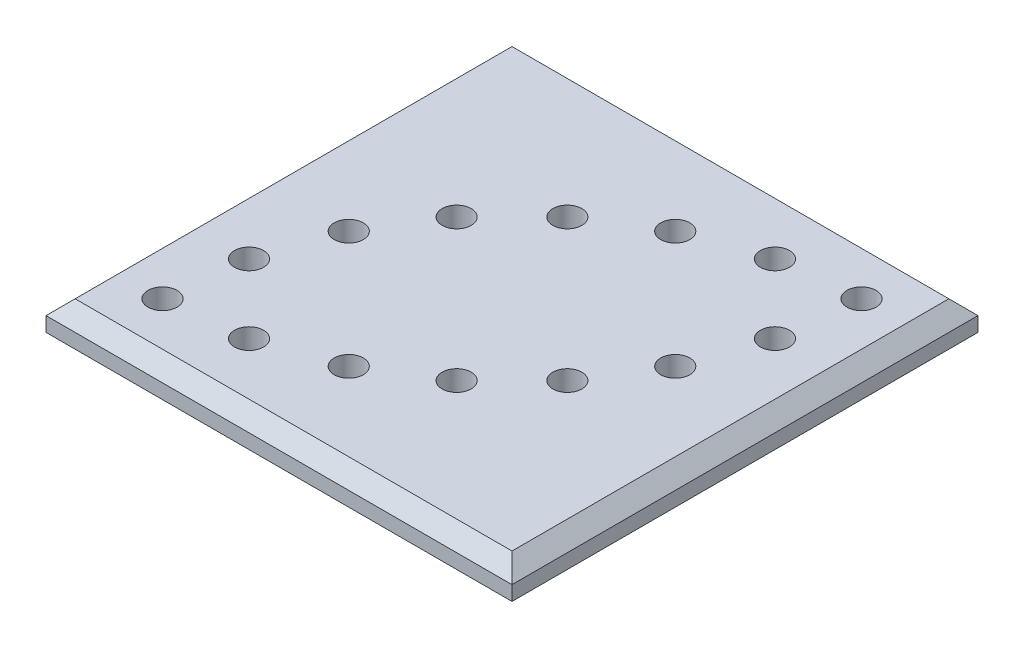
ISO-10303-21;
HEADER;
FILE_DESCRIPTION(('STEP AP214'),'2;1');
FILE_NAME('part.step','',(''),(''),'','','');
FILE_SCHEMA(('AUTOMOTIVE_DESIGN { 1 0 10303 214 1 1 1 1 }'));
ENDSEC;
DATA;
#1=APPLICATION_CONTEXT('core data for automotive mechanical design processes');
#2=APPLICATION_PROTOCOL_DEFINITION('international standard','automotive_design',2000,#1);
#3=PRODUCT_CONTEXT('',#1,'mechanical');
#4=PRODUCT('Part','Part','',(#3));
#5=PRODUCT_RELATED_PRODUCT_CATEGORY('part','',(#4));
#6=PRODUCT_DEFINITION_FORMATION('','',#4);
#7=PRODUCT_DEFINITION_CONTEXT('part definition',#1,'design');
#8=PRODUCT_DEFINITION('design','',#6,#7);
#9=PRODUCT_DEFINITION_SHAPE('','',#8);
#10=(LENGTH_UNIT() NAMED_UNIT(*) SI_UNIT(.MILLI.,.METRE.));
#11=(NAMED_UNIT(*) PLANE_ANGLE_UNIT() SI_UNIT($,.RADIAN.));
#12=(NAMED_UNIT(*) SI_UNIT($,.STERADIAN.) SOLID_ANGLE_UNIT());
#13=UNCERTAINTY_MEASURE_WITH_UNIT(LENGTH_MEASURE(1.E-05),#10,'distance_accuracy_value','');
#14=(GEOMETRIC_REPRESENTATION_CONTEXT(3) GLOBAL_UNCERTAINTY_ASSIGNED_CONTEXT((#13)) GLOBAL_UNIT_ASSIGNED_CONTEXT((#10,
#11,#12)) REPRESENTATION_CONTEXT('',''));
#15=CARTESIAN_POINT('',(0.,0.,0.));
#16=DIRECTION('',(0.,0.,1.));
#17=DIRECTION('',(1.,0.,0.));
#18=AXIS2_PLACEMENT_3D('',#15,#16,#17);
#19=CARTESIAN_POINT('',(50.8,9.525,50.8));
#20=DIRECTION('',(-1.,0.,0.));
#21=DIRECTION('',(0.,0.,1.));
#22=AXIS2_PLACEMENT_3D('',#19,#20,#21);
#23=PLANE('',#22);
#24=DIRECTION('',(0.,-1.,0.));
#25=VECTOR('',#24,1.);
#26=CARTESIAN_POINT('',(50.8,9.525,-50.8));
#27=LINE('',#26,#25);
#28=CARTESIAN_POINT('',(50.8,6.34999999999995,-50.8));
#29=VERTEX_POINT('',#28);
#30=CARTESIAN_POINT('',(50.8,3.175,-50.8));
#31=VERTEX_POINT('',#30);
#32=EDGE_CURVE('E176',#29,#31,#27,.T.);
#33=ORIENTED_EDGE('',*,*,#32,.F.);
#34=DIRECTION('',(0.,0.,1.));
#35=VECTOR('',#34,1.);
#36=CARTESIAN_POINT('',(50.8,6.34999999999995,50.8));
#37=LINE('',#36,#35);
#38=CARTESIAN_POINT('',(50.8,6.34999999999995,50.8));
#39=VERTEX_POINT('',#38);
#40=EDGE_CURVE('E11',#29,#39,#37,.T.);
#41=ORIENTED_EDGE('',*,*,#40,.T.);
#42=DIRECTION('',(0.,-1.,0.));
#43=VECTOR('',#42,1.);
#44=CARTESIAN_POINT('',(50.8,9.525,50.8));
#45=LINE('',#44,#43);
#46=CARTESIAN_POINT('',(50.8,3.175,50.8));
#47=VERTEX_POINT('',#46);
#48=EDGE_CURVE('E170',#39,#47,#45,.T.);
#49=ORIENTED_EDGE('',*,*,#48,.T.);
#50=DIRECTION('',(0.,0.,1.));
#51=VECTOR('',#50,1.);
#52=CARTESIAN_POINT('',(50.8,3.175,-50.8));
#53=LINE('',#52,#51);
#54=EDGE_CURVE('E161',#31,#47,#53,.T.);
#55=ORIENTED_EDGE('',*,*,#54,.F.);
#56=EDGE_LOOP('',(#33,#41,#49,#55));
#57=FACE_BOUND('',#56,.T.);
#58=ADVANCED_FACE('F33',(#57),#23,.F.);
#59=CARTESIAN_POINT('',(-50.8,9.525,-50.8));
#60=DIRECTION('',(0.,0.,1.));
#61=DIRECTION('',(1.,0.,0.));
#62=AXIS2_PLACEMENT_3D('',#59,#60,#61);
#63=PLANE('',#62);
#64=DIRECTION('',(0.,-1.,0.));
#65=VECTOR('',#64,1.);
#66=CARTESIAN_POINT('',(-50.8,9.525,-50.8));
#67=LINE('',#66,#65);
#68=CARTESIAN_POINT('',(-50.8,6.34999999999995,-50.8));
#69=VERTEX_POINT('',#68);
#70=CARTESIAN_POINT('',(-50.8,3.175,-50.8));
#71=VERTEX_POINT('',#70);
#72=EDGE_CURVE('E174',#69,#71,#67,.T.);
#73=ORIENTED_EDGE('',*,*,#72,.F.);
#74=DIRECTION('',(1.,0.,0.));
#75=VECTOR('',#74,1.);
#76=CARTESIAN_POINT('',(-50.8,6.34999999999995,-50.8));
#77=LINE('',#76,#75);
#78=EDGE_CURVE('E42',#69,#29,#77,.T.);
#79=ORIENTED_EDGE('',*,*,#78,.T.);
#80=ORIENTED_EDGE('',*,*,#32,.T.);
#81=DIRECTION('',(1.,0.,0.));
#82=VECTOR('',#81,1.);
#83=CARTESIAN_POINT('',(-50.8,3.175,-50.8));
#84=LINE('',#83,#82);
#85=EDGE_CURVE('E155',#71,#31,#84,.T.);
#86=ORIENTED_EDGE('',*,*,#85,.F.);
#87=EDGE_LOOP('',(#73,#79,#80,#86));
#88=FACE_BOUND('',#87,.T.);
#89=ADVANCED_FACE('F240',(#88),#63,.F.);
#90=CARTESIAN_POINT('',(-50.8,9.525,50.8));
#91=DIRECTION('',(1.,0.,0.));
#92=DIRECTION('',(0.,0.,-1.));
#93=AXIS2_PLACEMENT_3D('',#90,#91,#92);
#94=PLANE('',#93);
#95=DIRECTION('',(0.,-1.,0.));
#96=VECTOR('',#95,1.);
#97=CARTESIAN_POINT('',(-50.8,9.525,50.8));
#98=LINE('',#97,#96);
#99=CARTESIAN_POINT('',(-50.8,6.34999999999995,50.8));
#100=VERTEX_POINT('',#99);
#101=CARTESIAN_POINT('',(-50.8,3.175,50.8));
#102=VERTEX_POINT('',#101);
#103=EDGE_CURVE('E172',#100,#102,#98,.T.);
#104=ORIENTED_EDGE('',*,*,#103,.F.);
#105=DIRECTION('',(0.,0.,-1.));
#106=VECTOR('',#105,1.);
#107=CARTESIAN_POINT('',(-50.8,6.34999999999995,50.8));
#108=LINE('',#107,#106);
#109=EDGE_CURVE('E57',#100,#69,#108,.T.);
#110=ORIENTED_EDGE('',*,*,#109,.T.);
#111=ORIENTED_EDGE('',*,*,#72,.T.);
#112=DIRECTION('',(0.,0.,-1.));
#113=VECTOR('',#112,1.);
#114=CARTESIAN_POINT('',(-50.8,3.175,50.8));
#115=LINE('',#114,#113);
#116=EDGE_CURVE('E167',#102,#71,#115,.T.);
#117=ORIENTED_EDGE('',*,*,#116,.F.);
#118=EDGE_LOOP('',(#104,#110,#111,#117));
#119=FACE_BOUND('',#118,.T.);
#120=ADVANCED_FACE('F234',(#119),#94,.F.);
#121=CARTESIAN_POINT('',(-50.8,9.525,50.8));
#122=DIRECTION('',(0.,0.,-1.));
#123=DIRECTION('',(-1.,0.,0.));
#124=AXIS2_PLACEMENT_3D('',#121,#122,#123);
#125=PLANE('',#124);
#126=ORIENTED_EDGE('',*,*,#48,.F.);
#127=DIRECTION('',(-1.,0.,0.));
#128=VECTOR('',#127,1.);
#129=CARTESIAN_POINT('',(-50.8,6.34999999999995,50.8));
#130=LINE('',#129,#128);
#131=EDGE_CURVE('E187',#39,#100,#130,.T.);
#132=ORIENTED_EDGE('',*,*,#131,.T.);
#133=ORIENTED_EDGE('',*,*,#103,.T.);
#134=DIRECTION('',(-1.,0.,0.));
#135=VECTOR('',#134,1.);
#136=CARTESIAN_POINT('',(50.8,3.175,50.8));
#137=LINE('',#136,#135);
#138=EDGE_CURVE('E164',#47,#102,#137,.T.);
#139=ORIENTED_EDGE('',*,*,#138,.F.);
#140=EDGE_LOOP('',(#126,#132,#133,#139));
#141=FACE_BOUND('',#140,.T.);
#142=ADVANCED_FACE('F218',(#141),#125,.F.);
#143=CARTESIAN_POINT('',(0.,9.525,0.));
#144=DIRECTION('',(0.,-1.,0.));
#145=DIRECTION('',(0.,0.,-1.));
#146=AXIS2_PLACEMENT_3D('',#143,#144,#145);
#147=PLANE('',#146);
#148=CARTESIAN_POINT('',(21.143904832529,9.525,-36.1895069082551));
#149=DIRECTION('',(0.,1.,0.));
#150=DIRECTION('',(0.,0.,1.));
#151=AXIS2_PLACEMENT_3D('',#148,#149,#150);
#152=CIRCLE('',#151,3.175);
#153=CARTESIAN_POINT('',(21.143904832529,9.525,-33.0145069082551));
#154=VERTEX_POINT('',#153);
#155=EDGE_CURVE('E501',#154,#154,#152,.T.);
#156=ORIENTED_EDGE('',*,*,#155,.F.);
#157=EDGE_LOOP('',(#156));
#158=FACE_BOUND('',#157,.T.);
#159=CARTESIAN_POINT('',(5.03805907924214,9.525,-30.5538277341646));
#160=DIRECTION('',(0.,1.,0.));
#161=DIRECTION('',(0.,0.,1.));
#162=AXIS2_PLACEMENT_3D('',#159,#160,#161);
#163=CIRCLE('',#162,3.17499999999999);
#164=CARTESIAN_POINT('',(5.03805907924214,9.525,-27.3788277341646));
#165=VERTEX_POINT('',#164);
#166=EDGE_CURVE('E506',#165,#165,#163,.T.);
#167=ORIENTED_EDGE('',*,*,#166,.F.);
#168=EDGE_LOOP('',(#167));
#169=FACE_BOUND('',#168,.T.);
#170=CARTESIAN_POINT('',(-9.40992290163554,9.525,-21.4755589640641));
#171=DIRECTION('',(0.,1.,0.));
#172=DIRECTION('',(0.,0.,1.));
#173=AXIS2_PLACEMENT_3D('',#170,#171,#172);
#174=CIRCLE('',#173,3.175);
#175=CARTESIAN_POINT('',(-9.40992290163554,9.525,-18.3005589640641));
#176=VERTEX_POINT('',#175);
#177=EDGE_CURVE('E515',#176,#176,#174,.T.);
#178=ORIENTED_EDGE('',*,*,#177,.F.);
#179=EDGE_LOOP('',(#178));
#180=FACE_BOUND('',#179,.T.);
#181=CARTESIAN_POINT('',(-21.475558964064,9.525,-9.40992290163575));
#182=DIRECTION('',(0.,1.,0.));
#183=DIRECTION('',(0.,0.,1.));
#184=AXIS2_PLACEMENT_3D('',#181,#182,#183);
#185=CIRCLE('',#184,3.175);
#186=CARTESIAN_POINT('',(-21.475558964064,9.525,-6.23492290163575));
#187=VERTEX_POINT('',#186);
#188=EDGE_CURVE('E521',#187,#187,#185,.T.);
#189=ORIENTED_EDGE('',*,*,#188,.F.);
#190=EDGE_LOOP('',(#189));
#191=FACE_BOUND('',#190,.T.);
#192=CARTESIAN_POINT('',(-30.5538277341645,9.525,5.0380590792419));
#193=DIRECTION('',(0.,1.,0.));
#194=DIRECTION('',(0.,0.,1.));
#195=AXIS2_PLACEMENT_3D('',#192,#193,#194);
#196=CIRCLE('',#195,3.17499999999999);
#197=CARTESIAN_POINT('',(-30.5538277341645,9.525,8.2130590792419));
#198=VERTEX_POINT('',#197);
#199=EDGE_CURVE('E527',#198,#198,#196,.T.);
#200=ORIENTED_EDGE('',*,*,#199,.F.);
#201=EDGE_LOOP('',(#200));
#202=FACE_BOUND('',#201,.T.);
#203=CARTESIAN_POINT('',(-36.1895069082551,9.525,21.1439048325288));
#204=DIRECTION('',(0.,1.,0.));
#205=DIRECTION('',(0.,0.,1.));
#206=AXIS2_PLACEMENT_3D('',#203,#204,#205);
#207=CIRCLE('',#206,3.17499999999999);
#208=CARTESIAN_POINT('',(-36.1895069082551,9.525,24.3189048325288));
#209=VERTEX_POINT('',#208);
#210=EDGE_CURVE('E533',#209,#209,#207,.T.);
#211=ORIENTED_EDGE('',*,*,#210,.F.);
#212=EDGE_LOOP('',(#211));
#213=FACE_BOUND('',#212,.T.);
#214=CARTESIAN_POINT('',(-38.1,9.525,38.1));
#215=DIRECTION('',(0.,1.,0.));
#216=DIRECTION('',(0.,0.,1.));
#217=AXIS2_PLACEMENT_3D('',#214,#215,#216);
#218=CIRCLE('',#217,3.175);
#219=CARTESIAN_POINT('',(-38.1,9.525,41.275));
#220=VERTEX_POINT('',#219);
#221=EDGE_CURVE('E539',#220,#220,#218,.T.);
#222=ORIENTED_EDGE('',*,*,#221,.F.);
#223=EDGE_LOOP('',(#222));
#224=FACE_BOUND('',#223,.T.);
#225=CARTESIAN_POINT('',(-5.03805907924202,9.525,30.5538277341643));
#226=DIRECTION('',(0.,1.,0.));
#227=DIRECTION('',(0.,0.,1.));
#228=AXIS2_PLACEMENT_3D('',#225,#226,#227);
#229=CIRCLE('',#228,3.175);
#230=CARTESIAN_POINT('',(-5.03805907924202,9.525,33.7288277341643));
#231=VERTEX_POINT('',#230);
#232=EDGE_CURVE('E545',#231,#231,#229,.T.);
#233=ORIENTED_EDGE('',*,*,#232,.F.);
#234=EDGE_LOOP('',(#233));
#235=FACE_BOUND('',#234,.T.);
#236=CARTESIAN_POINT('',(9.40992290163559,9.525,21.4755589640638));
#237=DIRECTION('',(0.,1.,0.));
#238=DIRECTION('',(0.,0.,1.));
#239=AXIS2_PLACEMENT_3D('',#236,#237,#238);
#240=CIRCLE('',#239,3.17499999999999);
#241=CARTESIAN_POINT('',(9.40992290163559,9.525,24.6505589640638));
#242=VERTEX_POINT('',#241);
#243=EDGE_CURVE('E560',#242,#242,#240,.T.);
#244=ORIENTED_EDGE('',*,*,#243,.F.);
#245=EDGE_LOOP('',(#244));
#246=FACE_BOUND('',#245,.T.);
#247=CARTESIAN_POINT('',(21.475558964064,9.525,9.4099229016354));
#248=DIRECTION('',(0.,1.,0.));
#249=DIRECTION('',(0.,0.,1.));
#250=AXIS2_PLACEMENT_3D('',#247,#248,#249);
#251=CIRCLE('',#250,3.175);
#252=CARTESIAN_POINT('',(21.475558964064,9.525,12.5849229016354));
#253=VERTEX_POINT('',#252);
#254=EDGE_CURVE('E570',#253,#253,#251,.T.);
#255=ORIENTED_EDGE('',*,*,#254,.F.);
#256=EDGE_LOOP('',(#255));
#257=FACE_BOUND('',#256,.T.);
#258=CARTESIAN_POINT('',(30.5538277341644,9.525,-5.0380590792422));
#259=DIRECTION('',(0.,1.,0.));
#260=DIRECTION('',(0.,0.,1.));
#261=AXIS2_PLACEMENT_3D('',#258,#259,#260);
#262=CIRCLE('',#261,3.17500000000001);
#263=CARTESIAN_POINT('',(30.5538277341644,9.525,-1.86305907924219));
#264=VERTEX_POINT('',#263);
#265=EDGE_CURVE('E576',#264,#264,#262,.T.);
#266=ORIENTED_EDGE('',*,*,#265,.F.);
#267=EDGE_LOOP('',(#266));
#268=FACE_BOUND('',#267,.T.);
#269=CARTESIAN_POINT('',(36.189506908255,9.525,-21.143904832529));
#270=DIRECTION('',(0.,1.,0.));
#271=DIRECTION('',(0.,0.,1.));
#272=AXIS2_PLACEMENT_3D('',#269,#270,#271);
#273=CIRCLE('',#272,3.175);
#274=CARTESIAN_POINT('',(36.189506908255,9.525,-17.968904832529));
#275=VERTEX_POINT('',#274);
#276=EDGE_CURVE('E582',#275,#275,#273,.T.);
#277=ORIENTED_EDGE('',*,*,#276,.F.);
#278=EDGE_LOOP('',(#277));
#279=FACE_BOUND('',#278,.T.);
#280=CARTESIAN_POINT('',(38.1,9.525,-38.1000000000002));
#281=DIRECTION('',(0.,1.,0.));
#282=DIRECTION('',(0.,0.,1.));
#283=AXIS2_PLACEMENT_3D('',#280,#281,#282);
#284=CIRCLE('',#283,3.175);
#285=CARTESIAN_POINT('',(38.1,9.525,-34.9250000000002));
#286=VERTEX_POINT('',#285);
#287=EDGE_CURVE('E587',#286,#286,#284,.T.);
#288=ORIENTED_EDGE('',*,*,#287,.F.);
#289=EDGE_LOOP('',(#288));
#290=FACE_BOUND('',#289,.T.);
#291=CARTESIAN_POINT('',(-21.1439048325288,9.525,36.189506908255));
#292=DIRECTION('',(0.,1.,0.));
#293=DIRECTION('',(0.,0.,1.));
#294=AXIS2_PLACEMENT_3D('',#291,#292,#293);
#295=CIRCLE('',#294,3.175);
#296=CARTESIAN_POINT('',(-21.1439048325288,9.525,39.364506908255));
#297=VERTEX_POINT('',#296);
#298=EDGE_CURVE('E144',#297,#297,#295,.T.);
#299=ORIENTED_EDGE('',*,*,#298,.F.);
#300=EDGE_LOOP('',(#299));
#301=FACE_BOUND('',#300,.T.);
#302=DIRECTION('',(0.,0.,1.));
#303=VECTOR('',#302,1.);
#304=CARTESIAN_POINT('',(-47.625,9.525,0.));
#305=LINE('',#304,#303);
#306=CARTESIAN_POINT('',(-47.625,9.525,-47.625));
#307=VERTEX_POINT('',#306);
#308=CARTESIAN_POINT('',(-47.625,9.525,47.625));
#309=VERTEX_POINT('',#308);
#310=EDGE_CURVE('E182',#307,#309,#305,.T.);
#311=ORIENTED_EDGE('',*,*,#310,.T.);
#312=DIRECTION('',(1.,0.,0.));
#313=VECTOR('',#312,1.);
#314=CARTESIAN_POINT('',(0.,9.525,47.625));
#315=LINE('',#314,#313);
#316=CARTESIAN_POINT('',(47.625,9.525,47.625));
#317=VERTEX_POINT('',#316);
#318=EDGE_CURVE('E184',#309,#317,#315,.T.);
#319=ORIENTED_EDGE('',*,*,#318,.T.);
#320=DIRECTION('',(0.,0.,-1.));
#321=VECTOR('',#320,1.);
#322=CARTESIAN_POINT('',(47.625,9.525,0.));
#323=LINE('',#322,#321);
#324=CARTESIAN_POINT('',(47.625,9.525,-47.625));
#325=VERTEX_POINT('',#324);
#326=EDGE_CURVE('E178',#317,#325,#323,.T.);
#327=ORIENTED_EDGE('',*,*,#326,.T.);
#328=DIRECTION('',(-1.,0.,0.));
#329=VECTOR('',#328,1.);
#330=CARTESIAN_POINT('',(0.,9.525,-47.625));
#331=LINE('',#330,#329);
#332=EDGE_CURVE('E180',#325,#307,#331,.T.);
#333=ORIENTED_EDGE('',*,*,#332,.T.);
#334=EDGE_LOOP('',(#311,#319,#327,#333));
#335=FACE_BOUND('',#334,.T.);
#336=ADVANCED_FACE('F223',(#158,#169,#180,#191,#202,#213,#224,#235,#246,#257,#268,#279,#290,
#301,#335),#147,.F.);
#337=CARTESIAN_POINT('',(0.,3.175,0.));
#338=DIRECTION('',(0.,-1.,0.));
#339=DIRECTION('',(0.,0.,-1.));
#340=AXIS2_PLACEMENT_3D('',#337,#338,#339);
#341=PLANE('',#340);
#342=DIRECTION('',(1.,0.,0.));
#343=VECTOR('',#342,1.);
#344=CARTESIAN_POINT('',(-47.498,3.175,-47.498));
#345=LINE('',#344,#343);
#346=CARTESIAN_POINT('',(-47.498,3.175,-47.498));
#347=VERTEX_POINT('',#346);
#348=CARTESIAN_POINT('',(47.498,3.175,-47.498));
#349=VERTEX_POINT('',#348);
#350=EDGE_CURVE('E123',#347,#349,#345,.T.);
#351=ORIENTED_EDGE('',*,*,#350,.F.);
#352=DIRECTION('',(0.,0.,-1.));
#353=VECTOR('',#352,1.);
#354=CARTESIAN_POINT('',(-47.498,3.175,47.498));
#355=LINE('',#354,#353);
#356=CARTESIAN_POINT('',(-47.498,3.175,47.498));
#357=VERTEX_POINT('',#356);
#358=EDGE_CURVE('E133',#357,#347,#355,.T.);
#359=ORIENTED_EDGE('',*,*,#358,.F.);
#360=DIRECTION('',(-1.,0.,0.));
#361=VECTOR('',#360,1.);
#362=CARTESIAN_POINT('',(47.498,3.175,47.498));
#363=LINE('',#362,#361);
#364=CARTESIAN_POINT('',(47.498,3.175,47.498));
#365=VERTEX_POINT('',#364);
#366=EDGE_CURVE('E115',#365,#357,#363,.T.);
#367=ORIENTED_EDGE('',*,*,#366,.F.);
#368=DIRECTION('',(0.,0.,1.));
#369=VECTOR('',#368,1.);
#370=CARTESIAN_POINT('',(47.498,3.175,-47.498));
#371=LINE('',#370,#369);
#372=EDGE_CURVE('E130',#349,#365,#371,.T.);
#373=ORIENTED_EDGE('',*,*,#372,.F.);
#374=EDGE_LOOP('',(#351,#359,#367,#373));
#375=FACE_BOUND('',#374,.T.);
#376=ORIENTED_EDGE('',*,*,#85,.T.);
#377=ORIENTED_EDGE('',*,*,#54,.T.);
#378=ORIENTED_EDGE('',*,*,#138,.T.);
#379=ORIENTED_EDGE('',*,*,#116,.T.);
#380=EDGE_LOOP('',(#376,#377,#378,#379));
#381=FACE_BOUND('',#380,.T.);
#382=ADVANCED_FACE('F128',(#375,#381),#341,.T.);
#383=CARTESIAN_POINT('',(47.498,3.175,-47.498));
#384=DIRECTION('',(1.,0.,0.));
#385=DIRECTION('',(0.,0.,-1.));
#386=AXIS2_PLACEMENT_3D('',#383,#384,#385);
#387=PLANE('',#386);
#388=DIRECTION('',(0.,0.,1.));
#389=VECTOR('',#388,1.);
#390=CARTESIAN_POINT('',(47.498,0.,-47.498));
#391=LINE('',#390,#389);
#392=CARTESIAN_POINT('',(47.498,0.,-47.498));
#393=VERTEX_POINT('',#392);
#394=CARTESIAN_POINT('',(47.498,0.,47.498));
#395=VERTEX_POINT('',#394);
#396=EDGE_CURVE('E149',#393,#395,#391,.T.);
#397=ORIENTED_EDGE('',*,*,#396,.F.);
#398=DIRECTION('',(0.,-1.,0.));
#399=VECTOR('',#398,1.);
#400=CARTESIAN_POINT('',(47.498,3.175,-47.498));
#401=LINE('',#400,#399);
#402=EDGE_CURVE('E137',#349,#393,#401,.T.);
#403=ORIENTED_EDGE('',*,*,#402,.F.);
#404=ORIENTED_EDGE('',*,*,#372,.T.);
#405=DIRECTION('',(0.,-1.,0.));
#406=VECTOR('',#405,1.);
#407=CARTESIAN_POINT('',(47.498,3.175,47.498));
#408=LINE('',#407,#406);
#409=EDGE_CURVE('E111',#365,#395,#408,.T.);
#410=ORIENTED_EDGE('',*,*,#409,.T.);
#411=EDGE_LOOP('',(#397,#403,#404,#410));
#412=FACE_BOUND('',#411,.T.);
#413=ADVANCED_FACE('F136',(#412),#387,.T.);
#414=CARTESIAN_POINT('',(-47.498,3.175,-47.498));
#415=DIRECTION('',(0.,0.,-1.));
#416=DIRECTION('',(-1.,0.,0.));
#417=AXIS2_PLACEMENT_3D('',#414,#415,#416);
#418=PLANE('',#417);
#419=DIRECTION('',(1.,0.,0.));
#420=VECTOR('',#419,1.);
#421=CARTESIAN_POINT('',(-47.498,0.,-47.498));
#422=LINE('',#421,#420);
#423=CARTESIAN_POINT('',(-47.498,0.,-47.498));
#424=VERTEX_POINT('',#423);
#425=EDGE_CURVE('E138',#424,#393,#422,.T.);
#426=ORIENTED_EDGE('',*,*,#425,.F.);
#427=DIRECTION('',(0.,-1.,0.));
#428=VECTOR('',#427,1.);
#429=CARTESIAN_POINT('',(-47.498,3.175,-47.498));
#430=LINE('',#429,#428);
#431=EDGE_CURVE('E156',#347,#424,#430,.T.);
#432=ORIENTED_EDGE('',*,*,#431,.F.);
#433=ORIENTED_EDGE('',*,*,#350,.T.);
#434=ORIENTED_EDGE('',*,*,#402,.T.);
#435=EDGE_LOOP('',(#426,#432,#433,#434));
#436=FACE_BOUND('',#435,.T.);
#437=ADVANCED_FACE('F294',(#436),#418,.T.);
#438=CARTESIAN_POINT('',(-47.498,3.175,47.498));
#439=DIRECTION('',(-1.,0.,0.));
#440=DIRECTION('',(0.,0.,1.));
#441=AXIS2_PLACEMENT_3D('',#438,#439,#440);
#442=PLANE('',#441);
#443=DIRECTION('',(0.,0.,-1.));
#444=VECTOR('',#443,1.);
#445=CARTESIAN_POINT('',(-47.498,0.,47.498));
#446=LINE('',#445,#444);
#447=CARTESIAN_POINT('',(-47.498,0.,47.498));
#448=VERTEX_POINT('',#447);
#449=EDGE_CURVE('E141',#448,#424,#446,.T.);
#450=ORIENTED_EDGE('',*,*,#449,.F.);
#451=DIRECTION('',(0.,-1.,0.));
#452=VECTOR('',#451,1.);
#453=CARTESIAN_POINT('',(-47.498,3.175,47.498));
#454=LINE('',#453,#452);
#455=EDGE_CURVE('E122',#357,#448,#454,.T.);
#456=ORIENTED_EDGE('',*,*,#455,.F.);
#457=ORIENTED_EDGE('',*,*,#358,.T.);
#458=ORIENTED_EDGE('',*,*,#431,.T.);
#459=EDGE_LOOP('',(#450,#456,#457,#458));
#460=FACE_BOUND('',#459,.T.);
#461=ADVANCED_FACE('F264',(#460),#442,.T.);
#462=CARTESIAN_POINT('',(47.498,3.175,47.498));
#463=DIRECTION('',(0.,0.,1.));
#464=DIRECTION('',(1.,0.,0.));
#465=AXIS2_PLACEMENT_3D('',#462,#463,#464);
#466=PLANE('',#465);
#467=DIRECTION('',(-1.,0.,0.));
#468=VECTOR('',#467,1.);
#469=CARTESIAN_POINT('',(47.498,0.,47.498));
#470=LINE('',#469,#468);
#471=EDGE_CURVE('E117',#395,#448,#470,.T.);
#472=ORIENTED_EDGE('',*,*,#471,.F.);
#473=ORIENTED_EDGE('',*,*,#409,.F.);
#474=ORIENTED_EDGE('',*,*,#366,.T.);
#475=ORIENTED_EDGE('',*,*,#455,.T.);
#476=EDGE_LOOP('',(#472,#473,#474,#475));
#477=FACE_BOUND('',#476,.T.);
#478=ADVANCED_FACE('F113',(#477),#466,.T.);
#479=CARTESIAN_POINT('',(0.,0.,0.));
#480=DIRECTION('',(0.,-1.,0.));
#481=DIRECTION('',(0.,0.,-1.));
#482=AXIS2_PLACEMENT_3D('',#479,#480,#481);
#483=PLANE('',#482);
#484=CARTESIAN_POINT('',(21.143904832529,0.,-36.1895069082551));
#485=DIRECTION('',(0.,1.,0.));
#486=DIRECTION('',(0.,0.,1.));
#487=AXIS2_PLACEMENT_3D('',#484,#485,#486);
#488=CIRCLE('',#487,3.175);
#489=CARTESIAN_POINT('',(21.143904832529,0.,-33.0145069082551));
#490=VERTEX_POINT('',#489);
#491=EDGE_CURVE('E499',#490,#490,#488,.T.);
#492=ORIENTED_EDGE('',*,*,#491,.T.);
#493=EDGE_LOOP('',(#492));
#494=FACE_BOUND('',#493,.T.);
#495=CARTESIAN_POINT('',(5.03805907924214,0.,-30.5538277341646));
#496=DIRECTION('',(0.,1.,0.));
#497=DIRECTION('',(0.,0.,1.));
#498=AXIS2_PLACEMENT_3D('',#495,#496,#497);
#499=CIRCLE('',#498,3.17499999999999);
#500=CARTESIAN_POINT('',(5.03805907924214,0.,-27.3788277341646));
#501=VERTEX_POINT('',#500);
#502=EDGE_CURVE('E502',#501,#501,#499,.T.);
#503=ORIENTED_EDGE('',*,*,#502,.T.);
#504=EDGE_LOOP('',(#503));
#505=FACE_BOUND('',#504,.T.);
#506=CARTESIAN_POINT('',(-9.40992290163554,0.,-21.4755589640641));
#507=DIRECTION('',(0.,1.,0.));
#508=DIRECTION('',(0.,0.,1.));
#509=AXIS2_PLACEMENT_3D('',#506,#507,#508);
#510=CIRCLE('',#509,3.175);
#511=CARTESIAN_POINT('',(-9.40992290163554,0.,-18.3005589640641));
#512=VERTEX_POINT('',#511);
#513=EDGE_CURVE('E512',#512,#512,#510,.T.);
#514=ORIENTED_EDGE('',*,*,#513,.T.);
#515=EDGE_LOOP('',(#514));
#516=FACE_BOUND('',#515,.T.);
#517=CARTESIAN_POINT('',(-21.475558964064,0.,-9.40992290163575));
#518=DIRECTION('',(0.,1.,0.));
#519=DIRECTION('',(0.,0.,1.));
#520=AXIS2_PLACEMENT_3D('',#517,#518,#519);
#521=CIRCLE('',#520,3.175);
#522=CARTESIAN_POINT('',(-21.475558964064,0.,-6.23492290163575));
#523=VERTEX_POINT('',#522);
#524=EDGE_CURVE('E518',#523,#523,#521,.T.);
#525=ORIENTED_EDGE('',*,*,#524,.T.);
#526=EDGE_LOOP('',(#525));
#527=FACE_BOUND('',#526,.T.);
#528=CARTESIAN_POINT('',(-30.5538277341645,0.,5.0380590792419));
#529=DIRECTION('',(0.,1.,0.));
#530=DIRECTION('',(0.,0.,1.));
#531=AXIS2_PLACEMENT_3D('',#528,#529,#530);
#532=CIRCLE('',#531,3.17499999999999);
#533=CARTESIAN_POINT('',(-30.5538277341645,0.,8.2130590792419));
#534=VERTEX_POINT('',#533);
#535=EDGE_CURVE('E524',#534,#534,#532,.T.);
#536=ORIENTED_EDGE('',*,*,#535,.T.);
#537=EDGE_LOOP('',(#536));
#538=FACE_BOUND('',#537,.T.);
#539=CARTESIAN_POINT('',(-36.1895069082551,0.,21.1439048325288));
#540=DIRECTION('',(0.,1.,0.));
#541=DIRECTION('',(0.,0.,1.));
#542=AXIS2_PLACEMENT_3D('',#539,#540,#541);
#543=CIRCLE('',#542,3.17499999999999);
#544=CARTESIAN_POINT('',(-36.1895069082551,0.,24.3189048325288));
#545=VERTEX_POINT('',#544);
#546=EDGE_CURVE('E530',#545,#545,#543,.T.);
#547=ORIENTED_EDGE('',*,*,#546,.T.);
#548=EDGE_LOOP('',(#547));
#549=FACE_BOUND('',#548,.T.);
#550=CARTESIAN_POINT('',(-38.1,0.,38.1));
#551=DIRECTION('',(0.,1.,0.));
#552=DIRECTION('',(0.,0.,1.));
#553=AXIS2_PLACEMENT_3D('',#550,#551,#552);
#554=CIRCLE('',#553,3.175);
#555=CARTESIAN_POINT('',(-38.1,0.,41.275));
#556=VERTEX_POINT('',#555);
#557=EDGE_CURVE('E536',#556,#556,#554,.T.);
#558=ORIENTED_EDGE('',*,*,#557,.T.);
#559=EDGE_LOOP('',(#558));
#560=FACE_BOUND('',#559,.T.);
#561=CARTESIAN_POINT('',(-5.03805907924202,0.,30.5538277341643));
#562=DIRECTION('',(0.,1.,0.));
#563=DIRECTION('',(0.,0.,1.));
#564=AXIS2_PLACEMENT_3D('',#561,#562,#563);
#565=CIRCLE('',#564,3.175);
#566=CARTESIAN_POINT('',(-5.03805907924202,0.,33.7288277341643));
#567=VERTEX_POINT('',#566);
#568=EDGE_CURVE('E542',#567,#567,#565,.T.);
#569=ORIENTED_EDGE('',*,*,#568,.T.);
#570=EDGE_LOOP('',(#569));
#571=FACE_BOUND('',#570,.T.);
#572=CARTESIAN_POINT('',(9.40992290163559,0.,21.4755589640638));
#573=DIRECTION('',(0.,1.,0.));
#574=DIRECTION('',(0.,0.,1.));
#575=AXIS2_PLACEMENT_3D('',#572,#573,#574);
#576=CIRCLE('',#575,3.17499999999999);
#577=CARTESIAN_POINT('',(9.40992290163559,0.,24.6505589640638));
#578=VERTEX_POINT('',#577);
#579=EDGE_CURVE('E547',#578,#578,#576,.T.);
#580=ORIENTED_EDGE('',*,*,#579,.T.);
#581=EDGE_LOOP('',(#580));
#582=FACE_BOUND('',#581,.T.);
#583=CARTESIAN_POINT('',(21.475558964064,0.,9.4099229016354));
#584=DIRECTION('',(0.,1.,0.));
#585=DIRECTION('',(0.,0.,1.));
#586=AXIS2_PLACEMENT_3D('',#583,#584,#585);
#587=CIRCLE('',#586,3.175);
#588=CARTESIAN_POINT('',(21.475558964064,0.,12.5849229016354));
#589=VERTEX_POINT('',#588);
#590=EDGE_CURVE('E565',#589,#589,#587,.T.);
#591=ORIENTED_EDGE('',*,*,#590,.T.);
#592=EDGE_LOOP('',(#591));
#593=FACE_BOUND('',#592,.T.);
#594=CARTESIAN_POINT('',(30.5538277341644,0.,-5.0380590792422));
#595=DIRECTION('',(0.,1.,0.));
#596=DIRECTION('',(0.,0.,1.));
#597=AXIS2_PLACEMENT_3D('',#594,#595,#596);
#598=CIRCLE('',#597,3.17500000000001);
#599=CARTESIAN_POINT('',(30.5538277341644,0.,-1.86305907924219));
#600=VERTEX_POINT('',#599);
#601=EDGE_CURVE('E573',#600,#600,#598,.T.);
#602=ORIENTED_EDGE('',*,*,#601,.T.);
#603=EDGE_LOOP('',(#602));
#604=FACE_BOUND('',#603,.T.);
#605=CARTESIAN_POINT('',(36.189506908255,0.,-21.143904832529));
#606=DIRECTION('',(0.,1.,0.));
#607=DIRECTION('',(0.,0.,1.));
#608=AXIS2_PLACEMENT_3D('',#605,#606,#607);
#609=CIRCLE('',#608,3.175);
#610=CARTESIAN_POINT('',(36.189506908255,0.,-17.968904832529));
#611=VERTEX_POINT('',#610);
#612=EDGE_CURVE('E579',#611,#611,#609,.T.);
#613=ORIENTED_EDGE('',*,*,#612,.T.);
#614=EDGE_LOOP('',(#613));
#615=FACE_BOUND('',#614,.T.);
#616=CARTESIAN_POINT('',(38.1,0.,-38.1000000000002));
#617=DIRECTION('',(0.,1.,0.));
#618=DIRECTION('',(0.,0.,1.));
#619=AXIS2_PLACEMENT_3D('',#616,#617,#618);
#620=CIRCLE('',#619,3.175);
#621=CARTESIAN_POINT('',(38.1,0.,-34.9250000000002));
#622=VERTEX_POINT('',#621);
#623=EDGE_CURVE('E585',#622,#622,#620,.T.);
#624=ORIENTED_EDGE('',*,*,#623,.T.);
#625=EDGE_LOOP('',(#624));
#626=FACE_BOUND('',#625,.T.);
#627=CARTESIAN_POINT('',(-21.1439048325288,0.,36.189506908255));
#628=DIRECTION('',(0.,1.,0.));
#629=DIRECTION('',(0.,0.,1.));
#630=AXIS2_PLACEMENT_3D('',#627,#628,#629);
#631=CIRCLE('',#630,3.175);
#632=CARTESIAN_POINT('',(-21.1439048325288,0.,39.364506908255));
#633=VERTEX_POINT('',#632);
#634=EDGE_CURVE('E195',#633,#633,#631,.T.);
#635=ORIENTED_EDGE('',*,*,#634,.T.);
#636=EDGE_LOOP('',(#635));
#637=FACE_BOUND('',#636,.T.);
#638=ORIENTED_EDGE('',*,*,#425,.T.);
#639=ORIENTED_EDGE('',*,*,#396,.T.);
#640=ORIENTED_EDGE('',*,*,#471,.T.);
#641=ORIENTED_EDGE('',*,*,#449,.T.);
#642=EDGE_LOOP('',(#638,#639,#640,#641));
#643=FACE_BOUND('',#642,.T.);
#644=ADVANCED_FACE('F256',(#494,#505,#516,#527,#538,#549,#560,#571,#582,#593,#604,#615,#626,
#637,#643),#483,.T.);
#645=CARTESIAN_POINT('',(0.,9.525,-47.625));
#646=DIRECTION('',(0.,-0.707106781186546,0.707106781186549));
#647=DIRECTION('',(-1.,0.,0.));
#648=AXIS2_PLACEMENT_3D('',#645,#646,#647);
#649=PLANE('',#648);
#650=DIRECTION('',(-0.577350269189625,0.577350269189628,0.577350269189625));
#651=VECTOR('',#650,1.);
#652=CARTESIAN_POINT('',(31.75,25.4,-31.75));
#653=LINE('',#652,#651);
#654=EDGE_CURVE('E196',#29,#325,#653,.T.);
#655=ORIENTED_EDGE('',*,*,#654,.F.);
#656=ORIENTED_EDGE('',*,*,#78,.F.);
#657=DIRECTION('',(0.577350269189625,0.577350269189628,0.577350269189625));
#658=VECTOR('',#657,1.);
#659=CARTESIAN_POINT('',(-31.75,25.4,-31.75));
#660=LINE('',#659,#658);
#661=EDGE_CURVE('E37',#307,#69,#660,.F.);
#662=ORIENTED_EDGE('',*,*,#661,.F.);
#663=ORIENTED_EDGE('',*,*,#332,.F.);
#664=EDGE_LOOP('',(#655,#656,#662,#663));
#665=FACE_BOUND('',#664,.T.);
#666=ADVANCED_FACE('F35',(#665),#649,.F.);
#667=CARTESIAN_POINT('',(-47.625,9.525,0.));
#668=DIRECTION('',(0.707106781186549,-0.707106781186546,0.));
#669=DIRECTION('',(0.,0.,1.));
#670=AXIS2_PLACEMENT_3D('',#667,#668,#669);
#671=PLANE('',#670);
#672=ORIENTED_EDGE('',*,*,#661,.T.);
#673=ORIENTED_EDGE('',*,*,#109,.F.);
#674=DIRECTION('',(0.577350269189625,0.577350269189628,-0.577350269189625));
#675=VECTOR('',#674,1.);
#676=CARTESIAN_POINT('',(-31.75,25.4,31.75));
#677=LINE('',#676,#675);
#678=EDGE_CURVE('E194',#309,#100,#677,.F.);
#679=ORIENTED_EDGE('',*,*,#678,.F.);
#680=ORIENTED_EDGE('',*,*,#310,.F.);
#681=EDGE_LOOP('',(#672,#673,#679,#680));
#682=FACE_BOUND('',#681,.T.);
#683=ADVANCED_FACE('F206',(#682),#671,.F.);
#684=CARTESIAN_POINT('',(47.625,9.525,0.));
#685=DIRECTION('',(-0.707106781186549,-0.707106781186546,0.));
#686=DIRECTION('',(0.,0.,-1.));
#687=AXIS2_PLACEMENT_3D('',#684,#685,#686);
#688=PLANE('',#687);
#689=ORIENTED_EDGE('',*,*,#654,.T.);
#690=ORIENTED_EDGE('',*,*,#326,.F.);
#691=DIRECTION('',(0.577350269189625,-0.577350269189628,0.577350269189625));
#692=VECTOR('',#691,1.);
#693=CARTESIAN_POINT('',(31.75,25.4,31.75));
#694=LINE('',#693,#692);
#695=EDGE_CURVE('E192',#39,#317,#694,.F.);
#696=ORIENTED_EDGE('',*,*,#695,.F.);
#697=ORIENTED_EDGE('',*,*,#40,.F.);
#698=EDGE_LOOP('',(#689,#690,#696,#697));
#699=FACE_BOUND('',#698,.T.);
#700=ADVANCED_FACE('F211',(#699),#688,.F.);
#701=CARTESIAN_POINT('',(0.,9.525,47.625));
#702=DIRECTION('',(0.,-0.707106781186546,-0.707106781186549));
#703=DIRECTION('',(1.,0.,0.));
#704=AXIS2_PLACEMENT_3D('',#701,#702,#703);
#705=PLANE('',#704);
#706=ORIENTED_EDGE('',*,*,#678,.T.);
#707=ORIENTED_EDGE('',*,*,#131,.F.);
#708=ORIENTED_EDGE('',*,*,#695,.T.);
#709=ORIENTED_EDGE('',*,*,#318,.F.);
#710=EDGE_LOOP('',(#706,#707,#708,#709));
#711=FACE_BOUND('',#710,.T.);
#712=ADVANCED_FACE('F220',(#711),#705,.F.);
#713=CARTESIAN_POINT('',(-21.1439048325288,0.,36.189506908255));
#714=DIRECTION('',(0.,1.,0.));
#715=DIRECTION('',(0.,0.,1.));
#716=AXIS2_PLACEMENT_3D('',#713,#714,#715);
#717=CYLINDRICAL_SURFACE('',#716,3.175);
#718=ORIENTED_EDGE('',*,*,#634,.F.);
#719=EDGE_LOOP('',(#718));
#720=FACE_BOUND('',#719,.T.);
#721=ORIENTED_EDGE('',*,*,#298,.T.);
#722=EDGE_LOOP('',(#721));
#723=FACE_BOUND('',#722,.T.);
#724=ADVANCED_FACE('F250',(#720,#723),#717,.F.);
#725=CARTESIAN_POINT('',(38.1,0.,-38.1000000000002));
#726=DIRECTION('',(0.,1.,0.));
#727=DIRECTION('',(0.,0.,1.));
#728=AXIS2_PLACEMENT_3D('',#725,#726,#727);
#729=CYLINDRICAL_SURFACE('',#728,3.175);
#730=ORIENTED_EDGE('',*,*,#623,.F.);
#731=EDGE_LOOP('',(#730));
#732=FACE_BOUND('',#731,.T.);
#733=ORIENTED_EDGE('',*,*,#287,.T.);
#734=EDGE_LOOP('',(#733));
#735=FACE_BOUND('',#734,.T.);
#736=ADVANCED_FACE('F362',(#732,#735),#729,.F.);
#737=CARTESIAN_POINT('',(36.189506908255,0.,-21.143904832529));
#738=DIRECTION('',(0.,1.,0.));
#739=DIRECTION('',(0.,0.,1.));
#740=AXIS2_PLACEMENT_3D('',#737,#738,#739);
#741=CYLINDRICAL_SURFACE('',#740,3.175);
#742=ORIENTED_EDGE('',*,*,#612,.F.);
#743=EDGE_LOOP('',(#742));
#744=FACE_BOUND('',#743,.T.);
#745=ORIENTED_EDGE('',*,*,#276,.T.);
#746=EDGE_LOOP('',(#745));
#747=FACE_BOUND('',#746,.T.);
#748=ADVANCED_FACE('F371',(#744,#747),#741,.F.);
#749=CARTESIAN_POINT('',(30.5538277341644,0.,-5.0380590792422));
#750=DIRECTION('',(0.,1.,0.));
#751=DIRECTION('',(0.,0.,1.));
#752=AXIS2_PLACEMENT_3D('',#749,#750,#751);
#753=CYLINDRICAL_SURFACE('',#752,3.17500000000001);
#754=ORIENTED_EDGE('',*,*,#601,.F.);
#755=EDGE_LOOP('',(#754));
#756=FACE_BOUND('',#755,.T.);
#757=ORIENTED_EDGE('',*,*,#265,.T.);
#758=EDGE_LOOP('',(#757));
#759=FACE_BOUND('',#758,.T.);
#760=ADVANCED_FACE('F380',(#756,#759),#753,.F.);
#761=CARTESIAN_POINT('',(21.475558964064,0.,9.4099229016354));
#762=DIRECTION('',(0.,1.,0.));
#763=DIRECTION('',(0.,0.,1.));
#764=AXIS2_PLACEMENT_3D('',#761,#762,#763);
#765=CYLINDRICAL_SURFACE('',#764,3.175);
#766=ORIENTED_EDGE('',*,*,#590,.F.);
#767=EDGE_LOOP('',(#766));
#768=FACE_BOUND('',#767,.T.);
#769=ORIENTED_EDGE('',*,*,#254,.T.);
#770=EDGE_LOOP('',(#769));
#771=FACE_BOUND('',#770,.T.);
#772=ADVANCED_FACE('F389',(#768,#771),#765,.F.);
#773=CARTESIAN_POINT('',(9.40992290163559,0.,21.4755589640638));
#774=DIRECTION('',(0.,1.,0.));
#775=DIRECTION('',(0.,0.,1.));
#776=AXIS2_PLACEMENT_3D('',#773,#774,#775);
#777=CYLINDRICAL_SURFACE('',#776,3.17499999999999);
#778=ORIENTED_EDGE('',*,*,#579,.F.);
#779=EDGE_LOOP('',(#778));
#780=FACE_BOUND('',#779,.T.);
#781=ORIENTED_EDGE('',*,*,#243,.T.);
#782=EDGE_LOOP('',(#781));
#783=FACE_BOUND('',#782,.T.);
#784=ADVANCED_FACE('F398',(#780,#783),#777,.F.);
#785=CARTESIAN_POINT('',(-5.03805907924202,0.,30.5538277341643));
#786=DIRECTION('',(0.,1.,0.));
#787=DIRECTION('',(0.,0.,1.));
#788=AXIS2_PLACEMENT_3D('',#785,#786,#787);
#789=CYLINDRICAL_SURFACE('',#788,3.175);
#790=ORIENTED_EDGE('',*,*,#568,.F.);
#791=EDGE_LOOP('',(#790));
#792=FACE_BOUND('',#791,.T.);
#793=ORIENTED_EDGE('',*,*,#232,.T.);
#794=EDGE_LOOP('',(#793));
#795=FACE_BOUND('',#794,.T.);
#796=ADVANCED_FACE('F407',(#792,#795),#789,.F.);
#797=CARTESIAN_POINT('',(-38.1,0.,38.1));
#798=DIRECTION('',(0.,1.,0.));
#799=DIRECTION('',(0.,0.,1.));
#800=AXIS2_PLACEMENT_3D('',#797,#798,#799);
#801=CYLINDRICAL_SURFACE('',#800,3.175);
#802=ORIENTED_EDGE('',*,*,#557,.F.);
#803=EDGE_LOOP('',(#802));
#804=FACE_BOUND('',#803,.T.);
#805=ORIENTED_EDGE('',*,*,#221,.T.);
#806=EDGE_LOOP('',(#805));
#807=FACE_BOUND('',#806,.T.);
#808=ADVANCED_FACE('F416',(#804,#807),#801,.F.);
#809=CARTESIAN_POINT('',(-36.1895069082551,0.,21.1439048325288));
#810=DIRECTION('',(0.,1.,0.));
#811=DIRECTION('',(0.,0.,1.));
#812=AXIS2_PLACEMENT_3D('',#809,#810,#811);
#813=CYLINDRICAL_SURFACE('',#812,3.17499999999999);
#814=ORIENTED_EDGE('',*,*,#546,.F.);
#815=EDGE_LOOP('',(#814));
#816=FACE_BOUND('',#815,.T.);
#817=ORIENTED_EDGE('',*,*,#210,.T.);
#818=EDGE_LOOP('',(#817));
#819=FACE_BOUND('',#818,.T.);
#820=ADVANCED_FACE('F425',(#816,#819),#813,.F.);
#821=CARTESIAN_POINT('',(-30.5538277341645,0.,5.0380590792419));
#822=DIRECTION('',(0.,1.,0.));
#823=DIRECTION('',(0.,0.,1.));
#824=AXIS2_PLACEMENT_3D('',#821,#822,#823);
#825=CYLINDRICAL_SURFACE('',#824,3.17499999999999);
#826=ORIENTED_EDGE('',*,*,#535,.F.);
#827=EDGE_LOOP('',(#826));
#828=FACE_BOUND('',#827,.T.);
#829=ORIENTED_EDGE('',*,*,#199,.T.);
#830=EDGE_LOOP('',(#829));
#831=FACE_BOUND('',#830,.T.);
#832=ADVANCED_FACE('F434',(#828,#831),#825,.F.);
#833=CARTESIAN_POINT('',(-21.475558964064,0.,-9.40992290163575));
#834=DIRECTION('',(0.,1.,0.));
#835=DIRECTION('',(0.,0.,1.));
#836=AXIS2_PLACEMENT_3D('',#833,#834,#835);
#837=CYLINDRICAL_SURFACE('',#836,3.175);
#838=ORIENTED_EDGE('',*,*,#524,.F.);
#839=EDGE_LOOP('',(#838));
#840=FACE_BOUND('',#839,.T.);
#841=ORIENTED_EDGE('',*,*,#188,.T.);
#842=EDGE_LOOP('',(#841));
#843=FACE_BOUND('',#842,.T.);
#844=ADVANCED_FACE('F443',(#840,#843),#837,.F.);
#845=CARTESIAN_POINT('',(-9.40992290163554,0.,-21.4755589640641));
#846=DIRECTION('',(0.,1.,0.));
#847=DIRECTION('',(0.,0.,1.));
#848=AXIS2_PLACEMENT_3D('',#845,#846,#847);
#849=CYLINDRICAL_SURFACE('',#848,3.175);
#850=ORIENTED_EDGE('',*,*,#513,.F.);
#851=EDGE_LOOP('',(#850));
#852=FACE_BOUND('',#851,.T.);
#853=ORIENTED_EDGE('',*,*,#177,.T.);
#854=EDGE_LOOP('',(#853));
#855=FACE_BOUND('',#854,.T.);
#856=ADVANCED_FACE('F452',(#852,#855),#849,.F.);
#857=CARTESIAN_POINT('',(5.03805907924214,0.,-30.5538277341646));
#858=DIRECTION('',(0.,1.,0.));
#859=DIRECTION('',(0.,0.,1.));
#860=AXIS2_PLACEMENT_3D('',#857,#858,#859);
#861=CYLINDRICAL_SURFACE('',#860,3.17499999999999);
#862=ORIENTED_EDGE('',*,*,#502,.F.);
#863=EDGE_LOOP('',(#862));
#864=FACE_BOUND('',#863,.T.);
#865=ORIENTED_EDGE('',*,*,#166,.T.);
#866=EDGE_LOOP('',(#865));
#867=FACE_BOUND('',#866,.T.);
#868=ADVANCED_FACE('F461',(#864,#867),#861,.F.);
#869=CARTESIAN_POINT('',(21.143904832529,0.,-36.1895069082551));
#870=DIRECTION('',(0.,1.,0.));
#871=DIRECTION('',(0.,0.,1.));
#872=AXIS2_PLACEMENT_3D('',#869,#870,#871);
#873=CYLINDRICAL_SURFACE('',#872,3.175);
#874=ORIENTED_EDGE('',*,*,#491,.F.);
#875=EDGE_LOOP('',(#874));
#876=FACE_BOUND('',#875,.T.);
#877=ORIENTED_EDGE('',*,*,#155,.T.);
#878=EDGE_LOOP('',(#877));
#879=FACE_BOUND('',#878,.T.);
#880=ADVANCED_FACE('F470',(#876,#879),#873,.F.);
#881=CLOSED_SHELL('',(#58,#89,#120,#142,#336,#382,#413,#437,#461,#478,#644,#666,#683,#700,#712,
#724,#736,#748,#760,#772,#784,#796,#808,#820,#832,#844,#856,#868,#880));
#882=MANIFOLD_SOLID_BREP('B2',#881);
#883=ADVANCED_BREP_SHAPE_REPRESENTATION('',(#18,#882),#14);
#884=SHAPE_DEFINITION_REPRESENTATION(#9,#883);
ENDSEC;
END-ISO-10303-21;
